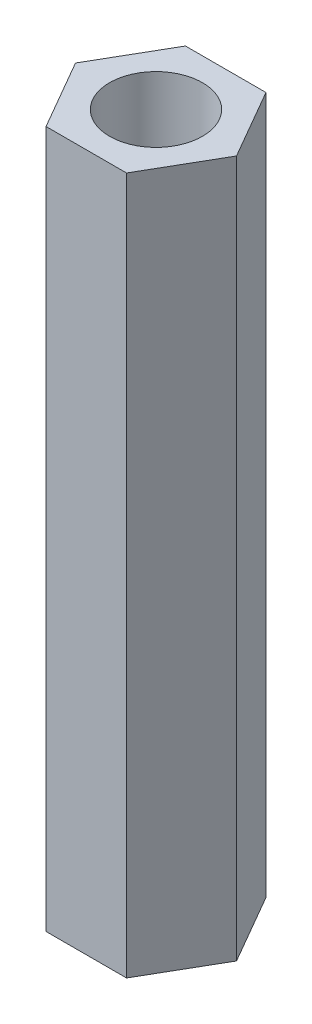
ISO-10303-21;
HEADER;
FILE_DESCRIPTION(('STEP AP214'),'2;1');
FILE_NAME('part.step','',(''),(''),'','','');
FILE_SCHEMA(('AUTOMOTIVE_DESIGN { 1 0 10303 214 1 1 1 1 }'));
ENDSEC;
DATA;
#1=APPLICATION_CONTEXT('core data for automotive mechanical design processes');
#2=APPLICATION_PROTOCOL_DEFINITION('international standard','automotive_design',2000,#1);
#3=PRODUCT_CONTEXT('',#1,'mechanical');
#4=PRODUCT('Part','Part','',(#3));
#5=PRODUCT_RELATED_PRODUCT_CATEGORY('part','',(#4));
#6=PRODUCT_DEFINITION_FORMATION('','',#4);
#7=PRODUCT_DEFINITION_CONTEXT('part definition',#1,'design');
#8=PRODUCT_DEFINITION('design','',#6,#7);
#9=PRODUCT_DEFINITION_SHAPE('','',#8);
#10=(LENGTH_UNIT() NAMED_UNIT(*) SI_UNIT(.MILLI.,.METRE.));
#11=(NAMED_UNIT(*) PLANE_ANGLE_UNIT() SI_UNIT($,.RADIAN.));
#12=(NAMED_UNIT(*) SI_UNIT($,.STERADIAN.) SOLID_ANGLE_UNIT());
#13=UNCERTAINTY_MEASURE_WITH_UNIT(LENGTH_MEASURE(1.E-05),#10,'distance_accuracy_value','');
#14=(GEOMETRIC_REPRESENTATION_CONTEXT(3) GLOBAL_UNCERTAINTY_ASSIGNED_CONTEXT((#13)) GLOBAL_UNIT_ASSIGNED_CONTEXT((#10,
#11,#12)) REPRESENTATION_CONTEXT('',''));
#15=CARTESIAN_POINT('',(0.,0.,0.));
#16=DIRECTION('',(0.,0.,1.));
#17=DIRECTION('',(1.,0.,0.));
#18=AXIS2_PLACEMENT_3D('',#15,#16,#17);
#19=CARTESIAN_POINT('',(0.,30.,0.));
#20=DIRECTION('',(0.,1.,0.));
#21=DIRECTION('',(0.,0.,1.));
#22=AXIS2_PLACEMENT_3D('',#19,#20,#21);
#23=PLANE('',#22);
#24=DIRECTION('',(0.5,0.,-0.866025403784439));
#25=VECTOR('',#24,1.);
#26=CARTESIAN_POINT('',(1.73205080756888,30.,3.));
#27=LINE('',#26,#25);
#28=CARTESIAN_POINT('',(1.73205080756888,30.,3.));
#29=VERTEX_POINT('',#28);
#30=CARTESIAN_POINT('',(3.46410161513775,30.,0.));
#31=VERTEX_POINT('',#30);
#32=EDGE_CURVE('E128',#29,#31,#27,.T.);
#33=ORIENTED_EDGE('',*,*,#32,.T.);
#34=DIRECTION('',(-0.5,0.,-0.866025403784439));
#35=VECTOR('',#34,1.);
#36=CARTESIAN_POINT('',(3.46410161513775,30.,0.));
#37=LINE('',#36,#35);
#38=CARTESIAN_POINT('',(1.73205080756887,30.,-3.));
#39=VERTEX_POINT('',#38);
#40=EDGE_CURVE('E86',#31,#39,#37,.T.);
#41=ORIENTED_EDGE('',*,*,#40,.T.);
#42=DIRECTION('',(-1.,0.,0.));
#43=VECTOR('',#42,1.);
#44=CARTESIAN_POINT('',(1.73205080756887,30.,-3.));
#45=LINE('',#44,#43);
#46=CARTESIAN_POINT('',(-1.73205080756888,30.,-3.));
#47=VERTEX_POINT('',#46);
#48=EDGE_CURVE('E99',#39,#47,#45,.T.);
#49=ORIENTED_EDGE('',*,*,#48,.T.);
#50=DIRECTION('',(-0.5,0.,0.866025403784439));
#51=VECTOR('',#50,1.);
#52=CARTESIAN_POINT('',(-1.73205080756888,30.,-3.));
#53=LINE('',#52,#51);
#54=CARTESIAN_POINT('',(-3.46410161513776,30.,0.));
#55=VERTEX_POINT('',#54);
#56=EDGE_CURVE('E93',#47,#55,#53,.T.);
#57=ORIENTED_EDGE('',*,*,#56,.T.);
#58=DIRECTION('',(0.5,0.,0.866025403784439));
#59=VECTOR('',#58,1.);
#60=CARTESIAN_POINT('',(-3.46410161513776,30.,0.));
#61=LINE('',#60,#59);
#62=CARTESIAN_POINT('',(-1.73205080756888,30.,3.));
#63=VERTEX_POINT('',#62);
#64=EDGE_CURVE('E97',#55,#63,#61,.T.);
#65=ORIENTED_EDGE('',*,*,#64,.T.);
#66=DIRECTION('',(1.,0.,0.));
#67=VECTOR('',#66,1.);
#68=CARTESIAN_POINT('',(-1.73205080756888,30.,3.));
#69=LINE('',#68,#67);
#70=EDGE_CURVE('E49',#63,#29,#69,.T.);
#71=ORIENTED_EDGE('',*,*,#70,.T.);
#72=EDGE_LOOP('',(#33,#41,#49,#57,#65,#71));
#73=FACE_BOUND('',#72,.T.);
#74=CARTESIAN_POINT('',(0.,30.,0.));
#75=DIRECTION('',(0.,1.,0.));
#76=DIRECTION('',(0.,0.,1.));
#77=AXIS2_PLACEMENT_3D('',#74,#75,#76);
#78=CIRCLE('',#77,2.);
#79=CARTESIAN_POINT('',(0.,30.,2.));
#80=VERTEX_POINT('',#79);
#81=EDGE_CURVE('E121',#80,#80,#78,.T.);
#82=ORIENTED_EDGE('',*,*,#81,.F.);
#83=EDGE_LOOP('',(#82));
#84=FACE_BOUND('',#83,.T.);
#85=ADVANCED_FACE('F32',(#73,#84),#23,.T.);
#86=CARTESIAN_POINT('',(0.,0.,0.));
#87=DIRECTION('',(0.,1.,0.));
#88=DIRECTION('',(0.,0.,1.));
#89=AXIS2_PLACEMENT_3D('',#86,#87,#88);
#90=PLANE('',#89);
#91=DIRECTION('',(0.5,0.,-0.866025403784439));
#92=VECTOR('',#91,1.);
#93=CARTESIAN_POINT('',(1.73205080756888,0.,3.));
#94=LINE('',#93,#92);
#95=CARTESIAN_POINT('',(1.73205080756888,0.,3.));
#96=VERTEX_POINT('',#95);
#97=CARTESIAN_POINT('',(3.46410161513775,0.,0.));
#98=VERTEX_POINT('',#97);
#99=EDGE_CURVE('E117',#96,#98,#94,.T.);
#100=ORIENTED_EDGE('',*,*,#99,.F.);
#101=DIRECTION('',(1.,0.,0.));
#102=VECTOR('',#101,1.);
#103=CARTESIAN_POINT('',(-1.73205080756888,0.,3.));
#104=LINE('',#103,#102);
#105=CARTESIAN_POINT('',(-1.73205080756888,0.,3.));
#106=VERTEX_POINT('',#105);
#107=EDGE_CURVE('E78',#106,#96,#104,.T.);
#108=ORIENTED_EDGE('',*,*,#107,.F.);
#109=DIRECTION('',(0.5,0.,0.866025403784439));
#110=VECTOR('',#109,1.);
#111=CARTESIAN_POINT('',(-3.46410161513776,0.,0.));
#112=LINE('',#111,#110);
#113=CARTESIAN_POINT('',(-3.46410161513776,0.,0.));
#114=VERTEX_POINT('',#113);
#115=EDGE_CURVE('E72',#114,#106,#112,.T.);
#116=ORIENTED_EDGE('',*,*,#115,.F.);
#117=DIRECTION('',(-0.5,0.,0.866025403784439));
#118=VECTOR('',#117,1.);
#119=CARTESIAN_POINT('',(-1.73205080756888,0.,-3.));
#120=LINE('',#119,#118);
#121=CARTESIAN_POINT('',(-1.73205080756888,0.,-3.));
#122=VERTEX_POINT('',#121);
#123=EDGE_CURVE('E107',#122,#114,#120,.T.);
#124=ORIENTED_EDGE('',*,*,#123,.F.);
#125=DIRECTION('',(-1.,0.,0.));
#126=VECTOR('',#125,1.);
#127=CARTESIAN_POINT('',(1.73205080756887,0.,-3.));
#128=LINE('',#127,#126);
#129=CARTESIAN_POINT('',(1.73205080756887,0.,-3.));
#130=VERTEX_POINT('',#129);
#131=EDGE_CURVE('E123',#130,#122,#128,.T.);
#132=ORIENTED_EDGE('',*,*,#131,.F.);
#133=DIRECTION('',(-0.5,0.,-0.866025403784439));
#134=VECTOR('',#133,1.);
#135=CARTESIAN_POINT('',(3.46410161513775,0.,0.));
#136=LINE('',#135,#134);
#137=EDGE_CURVE('E120',#98,#130,#136,.T.);
#138=ORIENTED_EDGE('',*,*,#137,.F.);
#139=EDGE_LOOP('',(#100,#108,#116,#124,#132,#138));
#140=FACE_BOUND('',#139,.T.);
#141=CARTESIAN_POINT('',(0.,0.,0.));
#142=DIRECTION('',(0.,1.,0.));
#143=DIRECTION('',(0.,0.,1.));
#144=AXIS2_PLACEMENT_3D('',#141,#142,#143);
#145=CIRCLE('',#144,2.);
#146=CARTESIAN_POINT('',(0.,0.,2.));
#147=VERTEX_POINT('',#146);
#148=EDGE_CURVE('E221',#147,#147,#145,.T.);
#149=ORIENTED_EDGE('',*,*,#148,.T.);
#150=EDGE_LOOP('',(#149));
#151=FACE_BOUND('',#150,.T.);
#152=ADVANCED_FACE('F137',(#140,#151),#90,.F.);
#153=CARTESIAN_POINT('',(1.73205080756888,30.,3.));
#154=DIRECTION('',(-0.866025403784439,0.,-0.5));
#155=DIRECTION('',(-0.5,0.,0.866025403784439));
#156=AXIS2_PLACEMENT_3D('',#153,#154,#155);
#157=PLANE('',#156);
#158=ORIENTED_EDGE('',*,*,#99,.T.);
#159=DIRECTION('',(0.,-1.,0.));
#160=VECTOR('',#159,1.);
#161=CARTESIAN_POINT('',(3.46410161513775,30.,0.));
#162=LINE('',#161,#160);
#163=EDGE_CURVE('E11',#31,#98,#162,.T.);
#164=ORIENTED_EDGE('',*,*,#163,.F.);
#165=ORIENTED_EDGE('',*,*,#32,.F.);
#166=DIRECTION('',(0.,-1.,0.));
#167=VECTOR('',#166,1.);
#168=CARTESIAN_POINT('',(1.73205080756888,30.,3.));
#169=LINE('',#168,#167);
#170=EDGE_CURVE('E113',#29,#96,#169,.T.);
#171=ORIENTED_EDGE('',*,*,#170,.T.);
#172=EDGE_LOOP('',(#158,#164,#165,#171));
#173=FACE_BOUND('',#172,.T.);
#174=ADVANCED_FACE('F34',(#173),#157,.F.);
#175=CARTESIAN_POINT('',(3.46410161513775,30.,0.));
#176=DIRECTION('',(-0.866025403784439,0.,0.5));
#177=DIRECTION('',(0.5,0.,0.866025403784439));
#178=AXIS2_PLACEMENT_3D('',#175,#176,#177);
#179=PLANE('',#178);
#180=ORIENTED_EDGE('',*,*,#137,.T.);
#181=DIRECTION('',(0.,-1.,0.));
#182=VECTOR('',#181,1.);
#183=CARTESIAN_POINT('',(1.73205080756887,30.,-3.));
#184=LINE('',#183,#182);
#185=EDGE_CURVE('E41',#39,#130,#184,.T.);
#186=ORIENTED_EDGE('',*,*,#185,.F.);
#187=ORIENTED_EDGE('',*,*,#40,.F.);
#188=ORIENTED_EDGE('',*,*,#163,.T.);
#189=EDGE_LOOP('',(#180,#186,#187,#188));
#190=FACE_BOUND('',#189,.T.);
#191=ADVANCED_FACE('F162',(#190),#179,.F.);
#192=CARTESIAN_POINT('',(1.73205080756887,30.,-3.));
#193=DIRECTION('',(0.,0.,1.));
#194=DIRECTION('',(1.,0.,0.));
#195=AXIS2_PLACEMENT_3D('',#192,#193,#194);
#196=PLANE('',#195);
#197=ORIENTED_EDGE('',*,*,#131,.T.);
#198=DIRECTION('',(0.,-1.,0.));
#199=VECTOR('',#198,1.);
#200=CARTESIAN_POINT('',(-1.73205080756888,30.,-3.));
#201=LINE('',#200,#199);
#202=EDGE_CURVE('E108',#47,#122,#201,.T.);
#203=ORIENTED_EDGE('',*,*,#202,.F.);
#204=ORIENTED_EDGE('',*,*,#48,.F.);
#205=ORIENTED_EDGE('',*,*,#185,.T.);
#206=EDGE_LOOP('',(#197,#203,#204,#205));
#207=FACE_BOUND('',#206,.T.);
#208=ADVANCED_FACE('F134',(#207),#196,.F.);
#209=CARTESIAN_POINT('',(-1.73205080756888,30.,-3.));
#210=DIRECTION('',(0.866025403784439,0.,0.5));
#211=DIRECTION('',(0.5,0.,-0.866025403784439));
#212=AXIS2_PLACEMENT_3D('',#209,#210,#211);
#213=PLANE('',#212);
#214=ORIENTED_EDGE('',*,*,#123,.T.);
#215=DIRECTION('',(0.,-1.,0.));
#216=VECTOR('',#215,1.);
#217=CARTESIAN_POINT('',(-3.46410161513776,30.,0.));
#218=LINE('',#217,#216);
#219=EDGE_CURVE('E104',#55,#114,#218,.T.);
#220=ORIENTED_EDGE('',*,*,#219,.F.);
#221=ORIENTED_EDGE('',*,*,#56,.F.);
#222=ORIENTED_EDGE('',*,*,#202,.T.);
#223=EDGE_LOOP('',(#214,#220,#221,#222));
#224=FACE_BOUND('',#223,.T.);
#225=ADVANCED_FACE('F105',(#224),#213,.F.);
#226=CARTESIAN_POINT('',(-3.46410161513776,30.,0.));
#227=DIRECTION('',(0.866025403784439,0.,-0.5));
#228=DIRECTION('',(-0.5,0.,-0.866025403784439));
#229=AXIS2_PLACEMENT_3D('',#226,#227,#228);
#230=PLANE('',#229);
#231=ORIENTED_EDGE('',*,*,#115,.T.);
#232=DIRECTION('',(0.,-1.,0.));
#233=VECTOR('',#232,1.);
#234=CARTESIAN_POINT('',(-1.73205080756888,30.,3.));
#235=LINE('',#234,#233);
#236=EDGE_CURVE('E109',#63,#106,#235,.T.);
#237=ORIENTED_EDGE('',*,*,#236,.F.);
#238=ORIENTED_EDGE('',*,*,#64,.F.);
#239=ORIENTED_EDGE('',*,*,#219,.T.);
#240=EDGE_LOOP('',(#231,#237,#238,#239));
#241=FACE_BOUND('',#240,.T.);
#242=ADVANCED_FACE('F111',(#241),#230,.F.);
#243=CARTESIAN_POINT('',(-1.73205080756888,30.,3.));
#244=DIRECTION('',(0.,0.,-1.));
#245=DIRECTION('',(-1.,0.,0.));
#246=AXIS2_PLACEMENT_3D('',#243,#244,#245);
#247=PLANE('',#246);
#248=ORIENTED_EDGE('',*,*,#107,.T.);
#249=ORIENTED_EDGE('',*,*,#170,.F.);
#250=ORIENTED_EDGE('',*,*,#70,.F.);
#251=ORIENTED_EDGE('',*,*,#236,.T.);
#252=EDGE_LOOP('',(#248,#249,#250,#251));
#253=FACE_BOUND('',#252,.T.);
#254=ADVANCED_FACE('F142',(#253),#247,.F.);
#255=CARTESIAN_POINT('',(0.,30.,0.));
#256=DIRECTION('',(0.,-1.,0.));
#257=DIRECTION('',(0.,0.,-1.));
#258=AXIS2_PLACEMENT_3D('',#255,#256,#257);
#259=CYLINDRICAL_SURFACE('',#258,2.);
#260=ORIENTED_EDGE('',*,*,#81,.T.);
#261=EDGE_LOOP('',(#260));
#262=FACE_BOUND('',#261,.T.);
#263=ORIENTED_EDGE('',*,*,#148,.F.);
#264=EDGE_LOOP('',(#263));
#265=FACE_BOUND('',#264,.T.);
#266=ADVANCED_FACE('F144',(#262,#265),#259,.F.);
#267=CLOSED_SHELL('',(#85,#152,#174,#191,#208,#225,#242,#254,#266));
#268=MANIFOLD_SOLID_BREP('B2',#267);
#269=ADVANCED_BREP_SHAPE_REPRESENTATION('',(#18,#268),#14);
#270=SHAPE_DEFINITION_REPRESENTATION(#9,#269);
ENDSEC;
END-ISO-10303-21;
